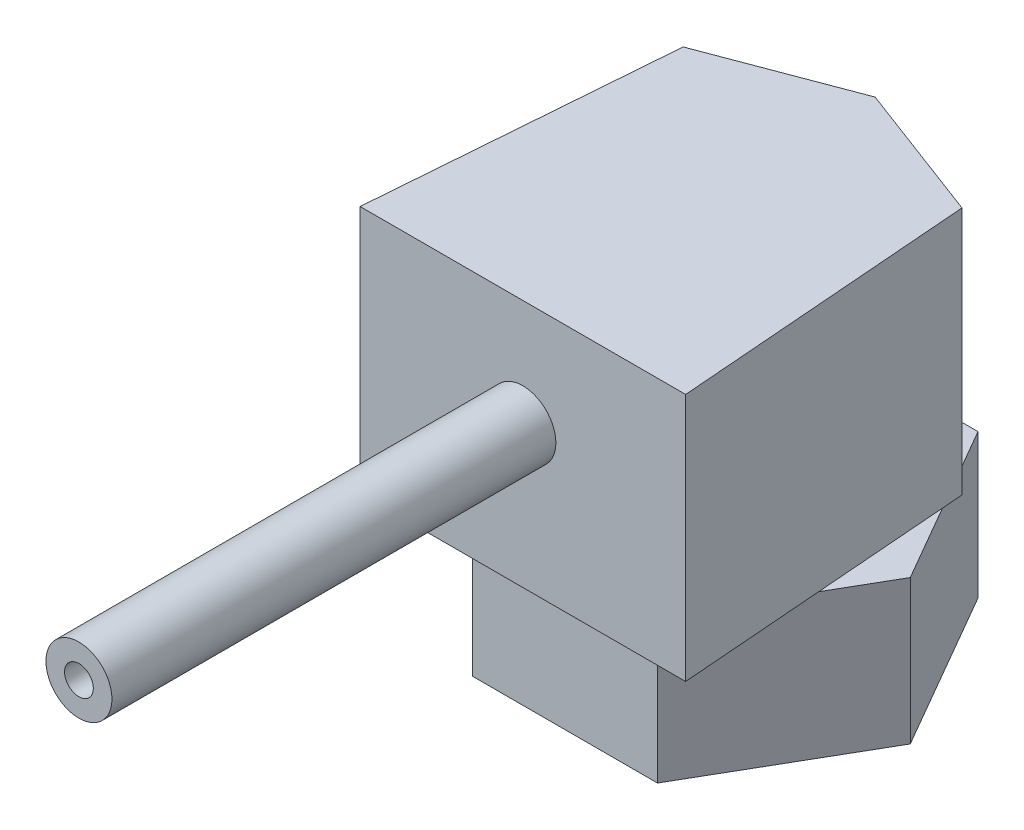
ISO-10303-21;
HEADER;
FILE_DESCRIPTION(('STEP AP214'),'2;1');
FILE_NAME('part.step','',(''),(''),'','','');
FILE_SCHEMA(('AUTOMOTIVE_DESIGN { 1 0 10303 214 1 1 1 1 }'));
ENDSEC;
DATA;
#1=APPLICATION_CONTEXT('core data for automotive mechanical design processes');
#2=APPLICATION_PROTOCOL_DEFINITION('international standard','automotive_design',2000,#1);
#3=PRODUCT_CONTEXT('',#1,'mechanical');
#4=PRODUCT('Part','Part','',(#3));
#5=PRODUCT_RELATED_PRODUCT_CATEGORY('part','',(#4));
#6=PRODUCT_DEFINITION_FORMATION('','',#4);
#7=PRODUCT_DEFINITION_CONTEXT('part definition',#1,'design');
#8=PRODUCT_DEFINITION('design','',#6,#7);
#9=PRODUCT_DEFINITION_SHAPE('','',#8);
#10=(LENGTH_UNIT() NAMED_UNIT(*) SI_UNIT(.MILLI.,.METRE.));
#11=(NAMED_UNIT(*) PLANE_ANGLE_UNIT() SI_UNIT($,.RADIAN.));
#12=(NAMED_UNIT(*) SI_UNIT($,.STERADIAN.) SOLID_ANGLE_UNIT());
#13=UNCERTAINTY_MEASURE_WITH_UNIT(LENGTH_MEASURE(1.E-05),#10,'distance_accuracy_value','');
#14=(GEOMETRIC_REPRESENTATION_CONTEXT(3) GLOBAL_UNCERTAINTY_ASSIGNED_CONTEXT((#13)) GLOBAL_UNIT_ASSIGNED_CONTEXT((#10,
#11,#12)) REPRESENTATION_CONTEXT('',''));
#15=CARTESIAN_POINT('',(0.,0.,0.));
#16=DIRECTION('',(0.,0.,1.));
#17=DIRECTION('',(1.,0.,0.));
#18=AXIS2_PLACEMENT_3D('',#15,#16,#17);
#19=CARTESIAN_POINT('',(0.,4.87,0.));
#20=DIRECTION('',(0.,1.,0.));
#21=DIRECTION('',(0.,0.,1.));
#22=AXIS2_PLACEMENT_3D('',#19,#20,#21);
#23=PLANE('',#22);
#24=DIRECTION('',(-0.0777412144974769,0.,-0.996973572151467));
#25=VECTOR('',#24,1.);
#26=CARTESIAN_POINT('',(4.71032986684992,4.87,-3.28958805354339));
#27=LINE('',#26,#25);
#28=CARTESIAN_POINT('',(5.11984690398497,4.87,1.96216503532384));
#29=VERTEX_POINT('',#28);
#30=CARTESIAN_POINT('',(4.76605534722032,4.87,-2.57494998692909));
#31=VERTEX_POINT('',#30);
#32=EDGE_CURVE('E232',#29,#31,#27,.T.);
#33=ORIENTED_EDGE('',*,*,#32,.F.);
#34=DIRECTION('',(0.499999999999995,0.,-0.866025403784441));
#35=VECTOR('',#34,1.);
#36=CARTESIAN_POINT('',(3.12635170766189,4.87,5.41499999999997));
#37=LINE('',#36,#35);
#38=CARTESIAN_POINT('',(6.25270341532365,4.87,0.));
#39=VERTEX_POINT('',#38);
#40=EDGE_CURVE('E182',#29,#39,#37,.T.);
#41=ORIENTED_EDGE('',*,*,#40,.T.);
#42=DIRECTION('',(-0.500000000000001,0.,-0.866025403784438));
#43=VECTOR('',#42,1.);
#44=CARTESIAN_POINT('',(6.25270341532365,4.87,0.));
#45=LINE('',#44,#43);
#46=EDGE_CURVE('E183',#39,#31,#45,.T.);
#47=ORIENTED_EDGE('',*,*,#46,.T.);
#48=EDGE_LOOP('',(#33,#41,#47));
#49=FACE_BOUND('',#48,.T.);
#50=ADVANCED_FACE('F41',(#49),#23,.T.);
#51=DIRECTION('',(-0.0777412144974769,0.,0.996973572151467));
#52=VECTOR('',#51,1.);
#53=CARTESIAN_POINT('',(-4.71032986684992,4.87,-3.28958805354339));
#54=LINE('',#53,#52);
#55=CARTESIAN_POINT('',(-4.76605534722032,4.87,-2.57494998692908));
#56=VERTEX_POINT('',#55);
#57=CARTESIAN_POINT('',(-5.11984690398497,4.87,1.96216503532383));
#58=VERTEX_POINT('',#57);
#59=EDGE_CURVE('E228',#56,#58,#54,.T.);
#60=ORIENTED_EDGE('',*,*,#59,.F.);
#61=DIRECTION('',(-0.499999999999995,0.,0.866025403784442));
#62=VECTOR('',#61,1.);
#63=CARTESIAN_POINT('',(-3.12635170766185,4.87,-5.41499999999999));
#64=LINE('',#63,#62);
#65=CARTESIAN_POINT('',(-6.25270341532365,4.87,0.));
#66=VERTEX_POINT('',#65);
#67=EDGE_CURVE('E189',#56,#66,#64,.T.);
#68=ORIENTED_EDGE('',*,*,#67,.T.);
#69=DIRECTION('',(0.500000000000007,0.,0.866025403784435));
#70=VECTOR('',#69,1.);
#71=CARTESIAN_POINT('',(-6.25270341532365,4.87,0.));
#72=LINE('',#71,#70);
#73=EDGE_CURVE('E193',#66,#58,#72,.T.);
#74=ORIENTED_EDGE('',*,*,#73,.T.);
#75=EDGE_LOOP('',(#60,#68,#74));
#76=FACE_BOUND('',#75,.T.);
#77=ADVANCED_FACE('F290',(#76),#23,.T.);
#78=CARTESIAN_POINT('',(3.12635170766189,4.87,5.41499999999997));
#79=DIRECTION('',(-0.866025403784442,0.,-0.499999999999995));
#80=DIRECTION('',(-0.499999999999995,0.,0.866025403784442));
#81=AXIS2_PLACEMENT_3D('',#78,#79,#80);
#82=PLANE('',#81);
#83=DIRECTION('',(0.499999999999995,0.,-0.866025403784441));
#84=VECTOR('',#83,1.);
#85=CARTESIAN_POINT('',(3.12635170766189,0.,5.41499999999997));
#86=LINE('',#85,#84);
#87=CARTESIAN_POINT('',(3.12635170766189,0.,5.41499999999997));
#88=VERTEX_POINT('',#87);
#89=CARTESIAN_POINT('',(6.25270341532365,0.,0.));
#90=VERTEX_POINT('',#89);
#91=EDGE_CURVE('E169',#88,#90,#86,.T.);
#92=ORIENTED_EDGE('',*,*,#91,.T.);
#93=DIRECTION('',(0.,-1.,0.));
#94=VECTOR('',#93,1.);
#95=CARTESIAN_POINT('',(6.25270341532365,4.87,0.));
#96=LINE('',#95,#94);
#97=EDGE_CURVE('E45',#39,#90,#96,.T.);
#98=ORIENTED_EDGE('',*,*,#97,.F.);
#99=ORIENTED_EDGE('',*,*,#40,.F.);
#100=CARTESIAN_POINT('',(3.12635170766189,4.87,5.41499999999997));
#101=VERTEX_POINT('',#100);
#102=EDGE_CURVE('E178',#101,#29,#37,.T.);
#103=ORIENTED_EDGE('',*,*,#102,.F.);
#104=DIRECTION('',(0.,-1.,0.));
#105=VECTOR('',#104,1.);
#106=CARTESIAN_POINT('',(3.12635170766189,4.87,5.41499999999997));
#107=LINE('',#106,#105);
#108=EDGE_CURVE('E197',#101,#88,#107,.T.);
#109=ORIENTED_EDGE('',*,*,#108,.T.);
#110=EDGE_LOOP('',(#92,#98,#99,#103,#109));
#111=FACE_BOUND('',#110,.T.);
#112=ADVANCED_FACE('F43',(#111),#82,.F.);
#113=CARTESIAN_POINT('',(6.25270341532365,4.87,0.));
#114=DIRECTION('',(-0.866025403784438,0.,0.500000000000001));
#115=DIRECTION('',(0.500000000000001,0.,0.866025403784438));
#116=AXIS2_PLACEMENT_3D('',#113,#114,#115);
#117=PLANE('',#116);
#118=DIRECTION('',(-0.500000000000001,0.,-0.866025403784438));
#119=VECTOR('',#118,1.);
#120=CARTESIAN_POINT('',(6.25270341532365,0.,0.));
#121=LINE('',#120,#119);
#122=CARTESIAN_POINT('',(3.12635170766181,0.,-5.41500000000001));
#123=VERTEX_POINT('',#122);
#124=EDGE_CURVE('E172',#90,#123,#121,.T.);
#125=ORIENTED_EDGE('',*,*,#124,.T.);
#126=DIRECTION('',(0.,-1.,0.));
#127=VECTOR('',#126,1.);
#128=CARTESIAN_POINT('',(3.12635170766181,4.87,-5.41500000000001));
#129=LINE('',#128,#127);
#130=CARTESIAN_POINT('',(3.12635170766181,4.87,-5.41500000000001));
#131=VERTEX_POINT('',#130);
#132=EDGE_CURVE('E218',#131,#123,#129,.T.);
#133=ORIENTED_EDGE('',*,*,#132,.F.);
#134=CARTESIAN_POINT('',(4.25413990126468,4.87,-3.46161354850352));
#135=VERTEX_POINT('',#134);
#136=EDGE_CURVE('E181',#135,#131,#45,.T.);
#137=ORIENTED_EDGE('',*,*,#136,.F.);
#138=EDGE_CURVE('E187',#31,#135,#45,.T.);
#139=ORIENTED_EDGE('',*,*,#138,.F.);
#140=ORIENTED_EDGE('',*,*,#46,.F.);
#141=ORIENTED_EDGE('',*,*,#97,.T.);
#142=EDGE_LOOP('',(#125,#133,#137,#139,#140,#141));
#143=FACE_BOUND('',#142,.T.);
#144=ADVANCED_FACE('F326',(#143),#117,.F.);
#145=CARTESIAN_POINT('',(3.12635170766181,4.87,-5.41500000000001));
#146=DIRECTION('',(0.,0.,1.));
#147=DIRECTION('',(1.,0.,0.));
#148=AXIS2_PLACEMENT_3D('',#145,#146,#147);
#149=PLANE('',#148);
#150=DIRECTION('',(-1.,0.,0.));
#151=VECTOR('',#150,1.);
#152=CARTESIAN_POINT('',(3.12635170766181,0.,-5.41500000000001));
#153=LINE('',#152,#151);
#154=CARTESIAN_POINT('',(-3.12635170766185,0.,-5.41499999999999));
#155=VERTEX_POINT('',#154);
#156=EDGE_CURVE('E200',#123,#155,#153,.T.);
#157=ORIENTED_EDGE('',*,*,#156,.T.);
#158=DIRECTION('',(0.,-1.,0.));
#159=VECTOR('',#158,1.);
#160=CARTESIAN_POINT('',(-3.12635170766185,4.87,-5.41499999999999));
#161=LINE('',#160,#159);
#162=CARTESIAN_POINT('',(-3.12635170766185,4.87,-5.41499999999999));
#163=VERTEX_POINT('',#162);
#164=EDGE_CURVE('E216',#163,#155,#161,.T.);
#165=ORIENTED_EDGE('',*,*,#164,.F.);
#166=DIRECTION('',(-1.,0.,0.));
#167=VECTOR('',#166,1.);
#168=CARTESIAN_POINT('',(3.12635170766181,4.87,-5.41500000000001));
#169=LINE('',#168,#167);
#170=EDGE_CURVE('E186',#131,#163,#169,.T.);
#171=ORIENTED_EDGE('',*,*,#170,.F.);
#172=ORIENTED_EDGE('',*,*,#132,.T.);
#173=EDGE_LOOP('',(#157,#165,#171,#172));
#174=FACE_BOUND('',#173,.T.);
#175=ADVANCED_FACE('F305',(#174),#149,.F.);
#176=CARTESIAN_POINT('',(-3.12635170766185,4.87,-5.41499999999999));
#177=DIRECTION('',(0.866025403784442,0.,0.499999999999995));
#178=DIRECTION('',(0.499999999999995,0.,-0.866025403784442));
#179=AXIS2_PLACEMENT_3D('',#176,#177,#178);
#180=PLANE('',#179);
#181=DIRECTION('',(-0.499999999999995,0.,0.866025403784442));
#182=VECTOR('',#181,1.);
#183=CARTESIAN_POINT('',(-3.12635170766185,0.,-5.41499999999999));
#184=LINE('',#183,#182);
#185=CARTESIAN_POINT('',(-6.25270341532365,0.,0.));
#186=VERTEX_POINT('',#185);
#187=EDGE_CURVE('E202',#155,#186,#184,.T.);
#188=ORIENTED_EDGE('',*,*,#187,.T.);
#189=DIRECTION('',(0.,-1.,0.));
#190=VECTOR('',#189,1.);
#191=CARTESIAN_POINT('',(-6.25270341532365,4.87,0.));
#192=LINE('',#191,#190);
#193=EDGE_CURVE('E213',#66,#186,#192,.T.);
#194=ORIENTED_EDGE('',*,*,#193,.F.);
#195=ORIENTED_EDGE('',*,*,#67,.F.);
#196=CARTESIAN_POINT('',(-4.25413990126469,4.87,-3.46161354850351));
#197=VERTEX_POINT('',#196);
#198=EDGE_CURVE('E192',#197,#56,#64,.T.);
#199=ORIENTED_EDGE('',*,*,#198,.F.);
#200=EDGE_CURVE('E190',#163,#197,#64,.T.);
#201=ORIENTED_EDGE('',*,*,#200,.F.);
#202=ORIENTED_EDGE('',*,*,#164,.T.);
#203=EDGE_LOOP('',(#188,#194,#195,#199,#201,#202));
#204=FACE_BOUND('',#203,.T.);
#205=ADVANCED_FACE('F291',(#204),#180,.F.);
#206=CARTESIAN_POINT('',(-6.25270341532365,4.87,0.));
#207=DIRECTION('',(0.866025403784434,0.,-0.500000000000007));
#208=DIRECTION('',(-0.500000000000007,0.,-0.866025403784435));
#209=AXIS2_PLACEMENT_3D('',#206,#207,#208);
#210=PLANE('',#209);
#211=DIRECTION('',(0.500000000000007,0.,0.866025403784435));
#212=VECTOR('',#211,1.);
#213=CARTESIAN_POINT('',(-6.25270341532365,0.,0.));
#214=LINE('',#213,#212);
#215=CARTESIAN_POINT('',(-3.12635170766178,0.,5.41500000000003));
#216=VERTEX_POINT('',#215);
#217=EDGE_CURVE('E204',#186,#216,#214,.T.);
#218=ORIENTED_EDGE('',*,*,#217,.T.);
#219=DIRECTION('',(0.,-1.,0.));
#220=VECTOR('',#219,1.);
#221=CARTESIAN_POINT('',(-3.12635170766178,4.87,5.41500000000003));
#222=LINE('',#221,#220);
#223=CARTESIAN_POINT('',(-3.12635170766178,4.87,5.41500000000003));
#224=VERTEX_POINT('',#223);
#225=EDGE_CURVE('E210',#224,#216,#222,.T.);
#226=ORIENTED_EDGE('',*,*,#225,.F.);
#227=EDGE_CURVE('E66',#58,#224,#72,.T.);
#228=ORIENTED_EDGE('',*,*,#227,.F.);
#229=ORIENTED_EDGE('',*,*,#73,.F.);
#230=ORIENTED_EDGE('',*,*,#193,.T.);
#231=EDGE_LOOP('',(#218,#226,#228,#229,#230));
#232=FACE_BOUND('',#231,.T.);
#233=ADVANCED_FACE('F294',(#232),#210,.F.);
#234=CARTESIAN_POINT('',(-3.12635170766178,4.87,5.41500000000003));
#235=DIRECTION('',(0.,0.,-1.));
#236=DIRECTION('',(-1.,0.,0.));
#237=AXIS2_PLACEMENT_3D('',#234,#235,#236);
#238=PLANE('',#237);
#239=DIRECTION('',(1.,0.,0.));
#240=VECTOR('',#239,1.);
#241=CARTESIAN_POINT('',(-3.12635170766178,0.,5.41500000000003));
#242=LINE('',#241,#240);
#243=EDGE_CURVE('E206',#216,#88,#242,.T.);
#244=ORIENTED_EDGE('',*,*,#243,.T.);
#245=ORIENTED_EDGE('',*,*,#108,.F.);
#246=DIRECTION('',(1.,0.,0.));
#247=VECTOR('',#246,1.);
#248=CARTESIAN_POINT('',(-3.12635170766178,4.87,5.41500000000003));
#249=LINE('',#248,#247);
#250=EDGE_CURVE('E195',#224,#101,#249,.T.);
#251=ORIENTED_EDGE('',*,*,#250,.F.);
#252=ORIENTED_EDGE('',*,*,#225,.T.);
#253=EDGE_LOOP('',(#244,#245,#251,#252));
#254=FACE_BOUND('',#253,.T.);
#255=ADVANCED_FACE('F296',(#254),#238,.F.);
#256=DIRECTION('',(-0.93568412133523,0.,-0.352838808921464));
#257=VECTOR('',#256,1.);
#258=CARTESIAN_POINT('',(0.,4.87,-5.06581481848502));
#259=LINE('',#258,#257);
#260=CARTESIAN_POINT('',(0.,4.87,-5.06581481848502));
#261=VERTEX_POINT('',#260);
#262=EDGE_CURVE('E168',#135,#261,#259,.T.);
#263=ORIENTED_EDGE('',*,*,#262,.F.);
#264=ORIENTED_EDGE('',*,*,#136,.T.);
#265=ORIENTED_EDGE('',*,*,#170,.T.);
#266=ORIENTED_EDGE('',*,*,#200,.T.);
#267=DIRECTION('',(-0.93568412133523,0.,0.352838808921464));
#268=VECTOR('',#267,1.);
#269=CARTESIAN_POINT('',(0.,4.87,-5.06581481848502));
#270=LINE('',#269,#268);
#271=EDGE_CURVE('E58',#261,#197,#270,.T.);
#272=ORIENTED_EDGE('',*,*,#271,.F.);
#273=EDGE_LOOP('',(#263,#264,#265,#266,#272));
#274=FACE_BOUND('',#273,.T.);
#275=ADVANCED_FACE('F302',(#274),#23,.T.);
#276=CARTESIAN_POINT('',(0.,0.,0.));
#277=DIRECTION('',(0.,1.,0.));
#278=DIRECTION('',(0.,0.,1.));
#279=AXIS2_PLACEMENT_3D('',#276,#277,#278);
#280=PLANE('',#279);
#281=CARTESIAN_POINT('',(0.,0.,0.));
#282=DIRECTION('',(0.,-1.,0.));
#283=DIRECTION('',(0.,0.,-1.));
#284=AXIS2_PLACEMENT_3D('',#281,#282,#283);
#285=CIRCLE('',#284,2.88643797427409);
#286=CARTESIAN_POINT('',(0.,0.,-2.88643797427409));
#287=VERTEX_POINT('',#286);
#288=EDGE_CURVE('E11',#287,#287,#285,.T.);
#289=ORIENTED_EDGE('',*,*,#288,.F.);
#290=EDGE_LOOP('',(#289));
#291=FACE_BOUND('',#290,.T.);
#292=ORIENTED_EDGE('',*,*,#91,.F.);
#293=ORIENTED_EDGE('',*,*,#243,.F.);
#294=ORIENTED_EDGE('',*,*,#217,.F.);
#295=ORIENTED_EDGE('',*,*,#187,.F.);
#296=ORIENTED_EDGE('',*,*,#156,.F.);
#297=ORIENTED_EDGE('',*,*,#124,.F.);
#298=EDGE_LOOP('',(#292,#293,#294,#295,#296,#297));
#299=FACE_BOUND('',#298,.T.);
#300=ADVANCED_FACE('F317',(#291,#299),#280,.F.);
#301=CARTESIAN_POINT('',(0.,4.87,0.));
#302=DIRECTION('',(0.,-1.,0.));
#303=DIRECTION('',(0.,0.,-1.));
#304=AXIS2_PLACEMENT_3D('',#301,#302,#303);
#305=PLANE('',#304);
#306=CARTESIAN_POINT('',(4.71032986684992,4.87,-3.28958805354339));
#307=VERTEX_POINT('',#306);
#308=EDGE_CURVE('E278',#31,#307,#27,.T.);
#309=ORIENTED_EDGE('',*,*,#308,.F.);
#310=ORIENTED_EDGE('',*,*,#138,.T.);
#311=EDGE_CURVE('E230',#307,#135,#259,.T.);
#312=ORIENTED_EDGE('',*,*,#311,.F.);
#313=EDGE_LOOP('',(#309,#310,#312));
#314=FACE_BOUND('',#313,.T.);
#315=ADVANCED_FACE('F322',(#314),#305,.T.);
#316=CARTESIAN_POINT('',(-4.71032986684992,4.87,-3.28958805354339));
#317=VERTEX_POINT('',#316);
#318=EDGE_CURVE('E238',#197,#317,#270,.T.);
#319=ORIENTED_EDGE('',*,*,#318,.F.);
#320=ORIENTED_EDGE('',*,*,#198,.T.);
#321=EDGE_CURVE('E234',#317,#56,#54,.T.);
#322=ORIENTED_EDGE('',*,*,#321,.F.);
#323=EDGE_LOOP('',(#319,#320,#322));
#324=FACE_BOUND('',#323,.T.);
#325=ADVANCED_FACE('F283',(#324),#305,.T.);
#326=CARTESIAN_POINT('',(0.,13.27,-5.06581481848502));
#327=DIRECTION('',(-0.352838808921465,0.,0.93568412133523));
#328=DIRECTION('',(0.93568412133523,0.,0.352838808921465));
#329=AXIS2_PLACEMENT_3D('',#326,#327,#328);
#330=PLANE('',#329);
#331=ORIENTED_EDGE('',*,*,#311,.T.);
#332=ORIENTED_EDGE('',*,*,#262,.T.);
#333=DIRECTION('',(0.,-1.,0.));
#334=VECTOR('',#333,1.);
#335=CARTESIAN_POINT('',(0.,13.27,-5.06581481848502));
#336=LINE('',#335,#334);
#337=CARTESIAN_POINT('',(0.,13.27,-5.06581481848502));
#338=VERTEX_POINT('',#337);
#339=EDGE_CURVE('E149',#338,#261,#336,.T.);
#340=ORIENTED_EDGE('',*,*,#339,.F.);
#341=DIRECTION('',(-0.93568412133523,0.,-0.352838808921464));
#342=VECTOR('',#341,1.);
#343=CARTESIAN_POINT('',(0.,13.27,-5.06581481848502));
#344=LINE('',#343,#342);
#345=CARTESIAN_POINT('',(4.71032986684992,13.27,-3.28958805354339));
#346=VERTEX_POINT('',#345);
#347=EDGE_CURVE('E155',#346,#338,#344,.T.);
#348=ORIENTED_EDGE('',*,*,#347,.F.);
#349=DIRECTION('',(0.,-1.,0.));
#350=VECTOR('',#349,1.);
#351=CARTESIAN_POINT('',(4.71032986684992,13.27,-3.28958805354339));
#352=LINE('',#351,#350);
#353=EDGE_CURVE('E255',#346,#307,#352,.T.);
#354=ORIENTED_EDGE('',*,*,#353,.T.);
#355=EDGE_LOOP('',(#331,#332,#340,#348,#354));
#356=FACE_BOUND('',#355,.T.);
#357=ADVANCED_FACE('F167',(#356),#330,.F.);
#358=CARTESIAN_POINT('',(0.,13.27,-5.06581481848502));
#359=DIRECTION('',(0.352838808921465,0.,0.93568412133523));
#360=DIRECTION('',(0.93568412133523,0.,-0.352838808921465));
#361=AXIS2_PLACEMENT_3D('',#358,#359,#360);
#362=PLANE('',#361);
#363=ORIENTED_EDGE('',*,*,#271,.T.);
#364=ORIENTED_EDGE('',*,*,#318,.T.);
#365=DIRECTION('',(0.,-1.,0.));
#366=VECTOR('',#365,1.);
#367=CARTESIAN_POINT('',(-4.71032986684992,13.27,-3.28958805354339));
#368=LINE('',#367,#366);
#369=CARTESIAN_POINT('',(-4.71032986684992,13.27,-3.28958805354339));
#370=VERTEX_POINT('',#369);
#371=EDGE_CURVE('E151',#370,#317,#368,.T.);
#372=ORIENTED_EDGE('',*,*,#371,.F.);
#373=DIRECTION('',(-0.93568412133523,0.,0.352838808921464));
#374=VECTOR('',#373,1.);
#375=CARTESIAN_POINT('',(0.,13.27,-5.06581481848502));
#376=LINE('',#375,#374);
#377=EDGE_CURVE('E145',#338,#370,#376,.T.);
#378=ORIENTED_EDGE('',*,*,#377,.F.);
#379=ORIENTED_EDGE('',*,*,#339,.T.);
#380=EDGE_LOOP('',(#363,#364,#372,#378,#379));
#381=FACE_BOUND('',#380,.T.);
#382=ADVANCED_FACE('F147',(#381),#362,.F.);
#383=CARTESIAN_POINT('',(-4.71032986684992,13.27,-3.28958805354339));
#384=DIRECTION('',(0.996973572151468,0.,0.0777412144974769));
#385=DIRECTION('',(0.0777412144974769,0.,-0.996973572151468));
#386=AXIS2_PLACEMENT_3D('',#383,#384,#385);
#387=PLANE('',#386);
#388=ORIENTED_EDGE('',*,*,#321,.T.);
#389=ORIENTED_EDGE('',*,*,#59,.T.);
#390=CARTESIAN_POINT('',(-5.5,4.87,6.83734729930611));
#391=VERTEX_POINT('',#390);
#392=EDGE_CURVE('E235',#58,#391,#54,.T.);
#393=ORIENTED_EDGE('',*,*,#392,.T.);
#394=DIRECTION('',(0.,-1.,0.));
#395=VECTOR('',#394,1.);
#396=CARTESIAN_POINT('',(-5.5,13.27,6.83734729930611));
#397=LINE('',#396,#395);
#398=CARTESIAN_POINT('',(-5.5,13.27,6.83734729930611));
#399=VERTEX_POINT('',#398);
#400=EDGE_CURVE('E174',#399,#391,#397,.T.);
#401=ORIENTED_EDGE('',*,*,#400,.F.);
#402=DIRECTION('',(-0.0777412144974769,0.,0.996973572151467));
#403=VECTOR('',#402,1.);
#404=CARTESIAN_POINT('',(-4.71032986684992,13.27,-3.28958805354339));
#405=LINE('',#404,#403);
#406=EDGE_CURVE('E154',#370,#399,#405,.T.);
#407=ORIENTED_EDGE('',*,*,#406,.F.);
#408=ORIENTED_EDGE('',*,*,#371,.T.);
#409=EDGE_LOOP('',(#388,#389,#393,#401,#407,#408));
#410=FACE_BOUND('',#409,.T.);
#411=ADVANCED_FACE('F272',(#410),#387,.F.);
#412=CARTESIAN_POINT('',(5.5,13.27,6.83734729930611));
#413=DIRECTION('',(0.,0.,-1.));
#414=DIRECTION('',(-1.,0.,0.));
#415=AXIS2_PLACEMENT_3D('',#412,#413,#414);
#416=PLANE('',#415);
#417=CARTESIAN_POINT('',(0.,9.66,6.83734729930611));
#418=DIRECTION('',(0.,0.,1.));
#419=DIRECTION('',(1.,0.,0.));
#420=AXIS2_PLACEMENT_3D('',#417,#418,#419);
#421=CIRCLE('',#420,1.115);
#422=CARTESIAN_POINT('',(1.115,9.66,6.83734729930611));
#423=VERTEX_POINT('',#422);
#424=EDGE_CURVE('E50',#423,#423,#421,.T.);
#425=ORIENTED_EDGE('',*,*,#424,.F.);
#426=EDGE_LOOP('',(#425));
#427=FACE_BOUND('',#426,.T.);
#428=DIRECTION('',(1.,0.,0.));
#429=VECTOR('',#428,1.);
#430=CARTESIAN_POINT('',(5.5,4.87,6.83734729930611));
#431=LINE('',#430,#429);
#432=CARTESIAN_POINT('',(5.5,4.87,6.83734729930611));
#433=VERTEX_POINT('',#432);
#434=EDGE_CURVE('E269',#391,#433,#431,.T.);
#435=ORIENTED_EDGE('',*,*,#434,.T.);
#436=DIRECTION('',(0.,-1.,0.));
#437=VECTOR('',#436,1.);
#438=CARTESIAN_POINT('',(5.5,13.27,6.83734729930611));
#439=LINE('',#438,#437);
#440=CARTESIAN_POINT('',(5.5,13.27,6.83734729930611));
#441=VERTEX_POINT('',#440);
#442=EDGE_CURVE('E256',#441,#433,#439,.T.);
#443=ORIENTED_EDGE('',*,*,#442,.F.);
#444=DIRECTION('',(1.,0.,0.));
#445=VECTOR('',#444,1.);
#446=CARTESIAN_POINT('',(-5.5,13.27,6.83734729930611));
#447=LINE('',#446,#445);
#448=EDGE_CURVE('E254',#399,#441,#447,.T.);
#449=ORIENTED_EDGE('',*,*,#448,.F.);
#450=ORIENTED_EDGE('',*,*,#400,.T.);
#451=EDGE_LOOP('',(#435,#443,#449,#450));
#452=FACE_BOUND('',#451,.T.);
#453=ADVANCED_FACE('F266',(#427,#452),#416,.F.);
#454=CARTESIAN_POINT('',(4.71032986684992,13.27,-3.28958805354339));
#455=DIRECTION('',(-0.996973572151468,0.,0.0777412144974769));
#456=DIRECTION('',(0.0777412144974769,0.,0.996973572151468));
#457=AXIS2_PLACEMENT_3D('',#454,#455,#456);
#458=PLANE('',#457);
#459=EDGE_CURVE('E164',#433,#29,#27,.T.);
#460=ORIENTED_EDGE('',*,*,#459,.T.);
#461=ORIENTED_EDGE('',*,*,#32,.T.);
#462=ORIENTED_EDGE('',*,*,#308,.T.);
#463=ORIENTED_EDGE('',*,*,#353,.F.);
#464=DIRECTION('',(-0.0777412144974769,0.,-0.996973572151467));
#465=VECTOR('',#464,1.);
#466=CARTESIAN_POINT('',(4.71032986684992,13.27,-3.28958805354339));
#467=LINE('',#466,#465);
#468=EDGE_CURVE('E160',#441,#346,#467,.T.);
#469=ORIENTED_EDGE('',*,*,#468,.F.);
#470=ORIENTED_EDGE('',*,*,#442,.T.);
#471=EDGE_LOOP('',(#460,#461,#462,#463,#469,#470));
#472=FACE_BOUND('',#471,.T.);
#473=ADVANCED_FACE('F331',(#472),#458,.F.);
#474=CARTESIAN_POINT('',(0.,13.27,0.));
#475=DIRECTION('',(0.,-1.,0.));
#476=DIRECTION('',(0.,0.,-1.));
#477=AXIS2_PLACEMENT_3D('',#474,#475,#476);
#478=PLANE('',#477);
#479=ORIENTED_EDGE('',*,*,#347,.T.);
#480=ORIENTED_EDGE('',*,*,#377,.T.);
#481=ORIENTED_EDGE('',*,*,#406,.T.);
#482=ORIENTED_EDGE('',*,*,#448,.T.);
#483=ORIENTED_EDGE('',*,*,#468,.T.);
#484=EDGE_LOOP('',(#479,#480,#481,#482,#483));
#485=FACE_BOUND('',#484,.T.);
#486=ADVANCED_FACE('F158',(#485),#478,.F.);
#487=ORIENTED_EDGE('',*,*,#250,.T.);
#488=ORIENTED_EDGE('',*,*,#102,.T.);
#489=ORIENTED_EDGE('',*,*,#459,.F.);
#490=ORIENTED_EDGE('',*,*,#434,.F.);
#491=ORIENTED_EDGE('',*,*,#392,.F.);
#492=ORIENTED_EDGE('',*,*,#227,.T.);
#493=EDGE_LOOP('',(#487,#488,#489,#490,#491,#492));
#494=FACE_BOUND('',#493,.T.);
#495=ADVANCED_FACE('F276',(#494),#305,.T.);
#496=CARTESIAN_POINT('',(0.,9.66,21.8373472993061));
#497=DIRECTION('',(0.,0.,1.));
#498=DIRECTION('',(1.,0.,0.));
#499=AXIS2_PLACEMENT_3D('',#496,#497,#498);
#500=PLANE('',#499);
#501=CARTESIAN_POINT('',(0.,9.66,21.8373472993061));
#502=DIRECTION('',(0.,0.,1.));
#503=DIRECTION('',(1.,0.,0.));
#504=AXIS2_PLACEMENT_3D('',#501,#502,#503);
#505=CIRCLE('',#504,1.115);
#506=CARTESIAN_POINT('',(1.115,9.66,21.8373472993061));
#507=VERTEX_POINT('',#506);
#508=EDGE_CURVE('E239',#507,#507,#505,.T.);
#509=ORIENTED_EDGE('',*,*,#508,.T.);
#510=EDGE_LOOP('',(#509));
#511=FACE_BOUND('',#510,.T.);
#512=CARTESIAN_POINT('',(0.,9.66,21.8373472993061));
#513=DIRECTION('',(0.,0.,1.));
#514=DIRECTION('',(1.,0.,0.));
#515=AXIS2_PLACEMENT_3D('',#512,#513,#514);
#516=CIRCLE('',#515,0.485823739942618);
#517=CARTESIAN_POINT('',(0.485823739942618,9.66,21.8373472993061));
#518=VERTEX_POINT('',#517);
#519=EDGE_CURVE('E242',#518,#518,#516,.T.);
#520=ORIENTED_EDGE('',*,*,#519,.F.);
#521=EDGE_LOOP('',(#520));
#522=FACE_BOUND('',#521,.T.);
#523=ADVANCED_FACE('F427',(#511,#522),#500,.T.);
#524=CARTESIAN_POINT('',(0.,9.66,21.8373472993061));
#525=DIRECTION('',(0.,0.,-1.));
#526=DIRECTION('',(-1.,0.,0.));
#527=AXIS2_PLACEMENT_3D('',#524,#525,#526);
#528=CYLINDRICAL_SURFACE('',#527,1.115);
#529=ORIENTED_EDGE('',*,*,#508,.F.);
#530=EDGE_LOOP('',(#529));
#531=FACE_BOUND('',#530,.T.);
#532=ORIENTED_EDGE('',*,*,#424,.T.);
#533=EDGE_LOOP('',(#532));
#534=FACE_BOUND('',#533,.T.);
#535=ADVANCED_FACE('F446',(#531,#534),#528,.T.);
#536=CARTESIAN_POINT('',(0.,9.66,21.8373472993061));
#537=DIRECTION('',(0.,0.,-1.));
#538=DIRECTION('',(-1.,0.,0.));
#539=AXIS2_PLACEMENT_3D('',#536,#537,#538);
#540=CYLINDRICAL_SURFACE('',#539,0.485823739942618);
#541=ORIENTED_EDGE('',*,*,#519,.T.);
#542=EDGE_LOOP('',(#541));
#543=FACE_BOUND('',#542,.T.);
#544=CARTESIAN_POINT('',(0.,9.66,6.83734729930611));
#545=DIRECTION('',(0.,0.,1.));
#546=DIRECTION('',(1.,0.,0.));
#547=AXIS2_PLACEMENT_3D('',#544,#545,#546);
#548=CIRCLE('',#547,0.485823739942618);
#549=CARTESIAN_POINT('',(0.485823739942618,9.66,6.83734729930611));
#550=VERTEX_POINT('',#549);
#551=EDGE_CURVE('E247',#550,#550,#548,.T.);
#552=ORIENTED_EDGE('',*,*,#551,.F.);
#553=EDGE_LOOP('',(#552));
#554=FACE_BOUND('',#553,.T.);
#555=ADVANCED_FACE('F436',(#543,#554),#540,.F.);
#556=ORIENTED_EDGE('',*,*,#551,.T.);
#557=EDGE_LOOP('',(#556));
#558=FACE_BOUND('',#557,.T.);
#559=ADVANCED_FACE('F405',(#558),#416,.F.);
#560=CARTESIAN_POINT('',(0.,-0.5,0.));
#561=DIRECTION('',(0.,1.,0.));
#562=DIRECTION('',(0.,0.,1.));
#563=AXIS2_PLACEMENT_3D('',#560,#561,#562);
#564=CYLINDRICAL_SURFACE('',#563,2.88643797427409);
#565=CARTESIAN_POINT('',(0.,-0.5,0.));
#566=DIRECTION('',(0.,-1.,0.));
#567=DIRECTION('',(0.,0.,-1.));
#568=AXIS2_PLACEMENT_3D('',#565,#566,#567);
#569=CIRCLE('',#568,2.88643797427409);
#570=CARTESIAN_POINT('',(0.,-0.5,-2.88643797427409));
#571=VERTEX_POINT('',#570);
#572=EDGE_CURVE('E516',#571,#571,#569,.T.);
#573=ORIENTED_EDGE('',*,*,#572,.F.);
#574=EDGE_LOOP('',(#573));
#575=FACE_BOUND('',#574,.T.);
#576=ORIENTED_EDGE('',*,*,#288,.T.);
#577=EDGE_LOOP('',(#576));
#578=FACE_BOUND('',#577,.T.);
#579=ADVANCED_FACE('F435',(#575,#578),#564,.T.);
#580=CARTESIAN_POINT('',(0.,-0.5,0.));
#581=DIRECTION('',(0.,-1.,0.));
#582=DIRECTION('',(0.,0.,-1.));
#583=AXIS2_PLACEMENT_3D('',#580,#581,#582);
#584=PLANE('',#583);
#585=ORIENTED_EDGE('',*,*,#572,.T.);
#586=EDGE_LOOP('',(#585));
#587=FACE_BOUND('',#586,.T.);
#588=ADVANCED_FACE('F469',(#587),#584,.T.);
#589=CLOSED_SHELL('',(#50,#77,#112,#144,#175,#205,#233,#255,#275,#300,#315,#325,#357,#382,#411,
#453,#473,#486,#495,#523,#535,#555,#559,#579,#588));
#590=MANIFOLD_SOLID_BREP('B2',#589);
#591=ADVANCED_BREP_SHAPE_REPRESENTATION('',(#18,#590),#14);
#592=SHAPE_DEFINITION_REPRESENTATION(#9,#591);
ENDSEC;
END-ISO-10303-21;
